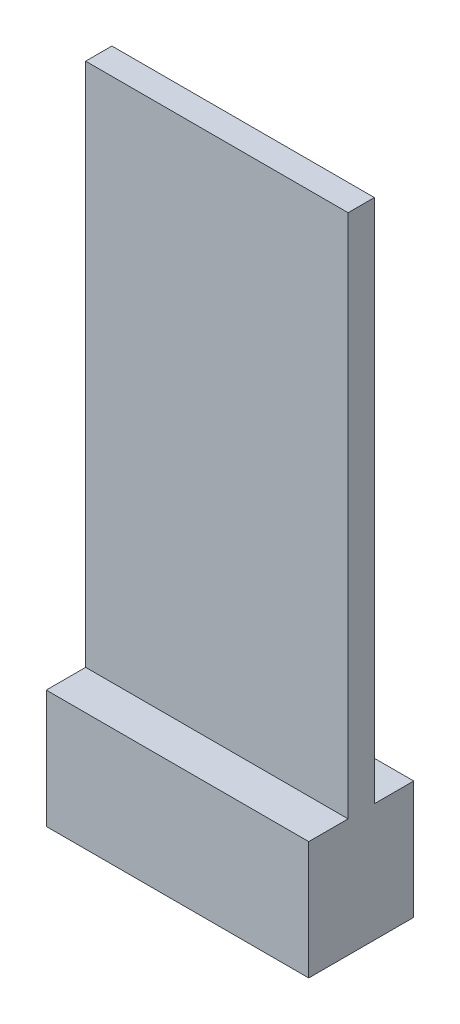
ISO-10303-21;
HEADER;
FILE_DESCRIPTION(('STEP AP214'),'2;1');
FILE_NAME('part.step','',(''),(''),'','','');
FILE_SCHEMA(('AUTOMOTIVE_DESIGN { 1 0 10303 214 1 1 1 1 }'));
ENDSEC;
DATA;
#1=APPLICATION_CONTEXT('core data for automotive mechanical design processes');
#2=APPLICATION_PROTOCOL_DEFINITION('international standard','automotive_design',2000,#1);
#3=PRODUCT_CONTEXT('',#1,'mechanical');
#4=PRODUCT('Part','Part','',(#3));
#5=PRODUCT_RELATED_PRODUCT_CATEGORY('part','',(#4));
#6=PRODUCT_DEFINITION_FORMATION('','',#4);
#7=PRODUCT_DEFINITION_CONTEXT('part definition',#1,'design');
#8=PRODUCT_DEFINITION('design','',#6,#7);
#9=PRODUCT_DEFINITION_SHAPE('','',#8);
#10=(LENGTH_UNIT() NAMED_UNIT(*) SI_UNIT(.MILLI.,.METRE.));
#11=(NAMED_UNIT(*) PLANE_ANGLE_UNIT() SI_UNIT($,.RADIAN.));
#12=(NAMED_UNIT(*) SI_UNIT($,.STERADIAN.) SOLID_ANGLE_UNIT());
#13=UNCERTAINTY_MEASURE_WITH_UNIT(LENGTH_MEASURE(1.E-05),#10,'distance_accuracy_value','');
#14=(GEOMETRIC_REPRESENTATION_CONTEXT(3) GLOBAL_UNCERTAINTY_ASSIGNED_CONTEXT((#13)) GLOBAL_UNIT_ASSIGNED_CONTEXT((#10,
#11,#12)) REPRESENTATION_CONTEXT('',''));
#15=CARTESIAN_POINT('',(0.,0.,0.));
#16=DIRECTION('',(0.,0.,1.));
#17=DIRECTION('',(1.,0.,0.));
#18=AXIS2_PLACEMENT_3D('',#15,#16,#17);
#19=CARTESIAN_POINT('',(10.,4.5,8.));
#20=DIRECTION('',(0.,-1.,0.));
#21=DIRECTION('',(1.,0.,0.));
#22=AXIS2_PLACEMENT_3D('',#19,#20,#21);
#23=PLANE('',#22);
#24=DIRECTION('',(1.,0.,0.));
#25=VECTOR('',#24,1.);
#26=CARTESIAN_POINT('',(-10.,4.5,5.));
#27=LINE('',#26,#25);
#28=CARTESIAN_POINT('',(-10.,4.5,5.));
#29=VERTEX_POINT('',#28);
#30=CARTESIAN_POINT('',(10.,4.5,5.));
#31=VERTEX_POINT('',#30);
#32=EDGE_CURVE('E142',#29,#31,#27,.T.);
#33=ORIENTED_EDGE('',*,*,#32,.F.);
#34=DIRECTION('',(0.,0.,-1.));
#35=VECTOR('',#34,1.);
#36=CARTESIAN_POINT('',(-10.,4.5,8.));
#37=LINE('',#36,#35);
#38=CARTESIAN_POINT('',(-10.,4.5,8.));
#39=VERTEX_POINT('',#38);
#40=EDGE_CURVE('E204',#39,#29,#37,.T.);
#41=ORIENTED_EDGE('',*,*,#40,.F.);
#42=DIRECTION('',(-1.,0.,0.));
#43=VECTOR('',#42,1.);
#44=CARTESIAN_POINT('',(10.,4.5,8.));
#45=LINE('',#44,#43);
#46=CARTESIAN_POINT('',(10.,4.5,8.));
#47=VERTEX_POINT('',#46);
#48=EDGE_CURVE('E193',#47,#39,#45,.T.);
#49=ORIENTED_EDGE('',*,*,#48,.F.);
#50=DIRECTION('',(0.,0.,-1.));
#51=VECTOR('',#50,1.);
#52=CARTESIAN_POINT('',(10.,4.5,8.));
#53=LINE('',#52,#51);
#54=EDGE_CURVE('E56',#47,#31,#53,.T.);
#55=ORIENTED_EDGE('',*,*,#54,.T.);
#56=EDGE_LOOP('',(#33,#41,#49,#55));
#57=FACE_BOUND('',#56,.T.);
#58=ADVANCED_FACE('F33',(#57),#23,.F.);
#59=DIRECTION('',(-1.,0.,0.));
#60=VECTOR('',#59,1.);
#61=CARTESIAN_POINT('',(-10.,4.5,3.));
#62=LINE('',#61,#60);
#63=CARTESIAN_POINT('',(10.,4.5,3.));
#64=VERTEX_POINT('',#63);
#65=CARTESIAN_POINT('',(-10.,4.5,3.));
#66=VERTEX_POINT('',#65);
#67=EDGE_CURVE('E48',#64,#66,#62,.T.);
#68=ORIENTED_EDGE('',*,*,#67,.F.);
#69=CARTESIAN_POINT('',(10.,4.5,0.));
#70=VERTEX_POINT('',#69);
#71=EDGE_CURVE('E146',#64,#70,#53,.T.);
#72=ORIENTED_EDGE('',*,*,#71,.T.);
#73=DIRECTION('',(-1.,0.,0.));
#74=VECTOR('',#73,1.);
#75=CARTESIAN_POINT('',(10.,4.5,0.));
#76=LINE('',#75,#74);
#77=CARTESIAN_POINT('',(-10.,4.5,0.));
#78=VERTEX_POINT('',#77);
#79=EDGE_CURVE('E189',#70,#78,#76,.T.);
#80=ORIENTED_EDGE('',*,*,#79,.T.);
#81=EDGE_CURVE('E195',#66,#78,#37,.T.);
#82=ORIENTED_EDGE('',*,*,#81,.F.);
#83=EDGE_LOOP('',(#68,#72,#80,#82));
#84=FACE_BOUND('',#83,.T.);
#85=ADVANCED_FACE('F216',(#84),#23,.F.);
#86=CARTESIAN_POINT('',(-10.,-4.5,8.));
#87=DIRECTION('',(1.,0.,0.));
#88=DIRECTION('',(0.,1.,0.));
#89=AXIS2_PLACEMENT_3D('',#86,#87,#88);
#90=PLANE('',#89);
#91=DIRECTION('',(0.,0.,-1.));
#92=VECTOR('',#91,1.);
#93=CARTESIAN_POINT('',(-10.,2.5,2.));
#94=LINE('',#93,#92);
#95=CARTESIAN_POINT('',(-10.,2.5,6.));
#96=VERTEX_POINT('',#95);
#97=CARTESIAN_POINT('',(-10.,2.5,2.));
#98=VERTEX_POINT('',#97);
#99=EDGE_CURVE('E149',#96,#98,#94,.T.);
#100=ORIENTED_EDGE('',*,*,#99,.F.);
#101=DIRECTION('',(0.,1.,0.));
#102=VECTOR('',#101,1.);
#103=CARTESIAN_POINT('',(-10.,-2.5,6.));
#104=LINE('',#103,#102);
#105=CARTESIAN_POINT('',(-10.,-2.5,6.));
#106=VERTEX_POINT('',#105);
#107=EDGE_CURVE('E147',#106,#96,#104,.T.);
#108=ORIENTED_EDGE('',*,*,#107,.F.);
#109=DIRECTION('',(0.,0.,1.));
#110=VECTOR('',#109,1.);
#111=CARTESIAN_POINT('',(-10.,-2.5,2.));
#112=LINE('',#111,#110);
#113=CARTESIAN_POINT('',(-10.,-2.5,2.));
#114=VERTEX_POINT('',#113);
#115=EDGE_CURVE('E159',#114,#106,#112,.T.);
#116=ORIENTED_EDGE('',*,*,#115,.F.);
#117=DIRECTION('',(0.,-1.,0.));
#118=VECTOR('',#117,1.);
#119=CARTESIAN_POINT('',(-10.,-2.5,2.));
#120=LINE('',#119,#118);
#121=EDGE_CURVE('E171',#98,#114,#120,.T.);
#122=ORIENTED_EDGE('',*,*,#121,.F.);
#123=EDGE_LOOP('',(#100,#108,#116,#122));
#124=FACE_BOUND('',#123,.T.);
#125=DIRECTION('',(0.,-1.,0.));
#126=VECTOR('',#125,1.);
#127=CARTESIAN_POINT('',(-10.,-4.5,0.));
#128=LINE('',#127,#126);
#129=CARTESIAN_POINT('',(-10.,-4.5,0.));
#130=VERTEX_POINT('',#129);
#131=EDGE_CURVE('E178',#78,#130,#128,.T.);
#132=ORIENTED_EDGE('',*,*,#131,.T.);
#133=DIRECTION('',(0.,0.,-1.));
#134=VECTOR('',#133,1.);
#135=CARTESIAN_POINT('',(-10.,-4.5,8.));
#136=LINE('',#135,#134);
#137=CARTESIAN_POINT('',(-10.,-4.5,8.));
#138=VERTEX_POINT('',#137);
#139=EDGE_CURVE('E11',#138,#130,#136,.T.);
#140=ORIENTED_EDGE('',*,*,#139,.F.);
#141=DIRECTION('',(0.,-1.,0.));
#142=VECTOR('',#141,1.);
#143=CARTESIAN_POINT('',(-10.,-4.5,8.));
#144=LINE('',#143,#142);
#145=EDGE_CURVE('E185',#39,#138,#144,.T.);
#146=ORIENTED_EDGE('',*,*,#145,.F.);
#147=ORIENTED_EDGE('',*,*,#40,.T.);
#148=DIRECTION('',(0.,-1.,0.));
#149=VECTOR('',#148,1.);
#150=CARTESIAN_POINT('',(-10.,44.5,5.));
#151=LINE('',#150,#149);
#152=CARTESIAN_POINT('',(-10.,44.5,5.));
#153=VERTEX_POINT('',#152);
#154=EDGE_CURVE('E151',#153,#29,#151,.T.);
#155=ORIENTED_EDGE('',*,*,#154,.F.);
#156=DIRECTION('',(0.,0.,1.));
#157=VECTOR('',#156,1.);
#158=CARTESIAN_POINT('',(-10.,44.5,3.));
#159=LINE('',#158,#157);
#160=CARTESIAN_POINT('',(-10.,44.5,3.));
#161=VERTEX_POINT('',#160);
#162=EDGE_CURVE('E132',#161,#153,#159,.T.);
#163=ORIENTED_EDGE('',*,*,#162,.F.);
#164=DIRECTION('',(0.,-1.,0.));
#165=VECTOR('',#164,1.);
#166=CARTESIAN_POINT('',(-10.,44.5,3.));
#167=LINE('',#166,#165);
#168=EDGE_CURVE('E129',#161,#66,#167,.T.);
#169=ORIENTED_EDGE('',*,*,#168,.T.);
#170=ORIENTED_EDGE('',*,*,#81,.T.);
#171=EDGE_LOOP('',(#132,#140,#146,#147,#155,#163,#169,#170));
#172=FACE_BOUND('',#171,.T.);
#173=ADVANCED_FACE('F35',(#124,#172),#90,.F.);
#174=CARTESIAN_POINT('',(10.,-4.5,8.));
#175=DIRECTION('',(0.,1.,0.));
#176=DIRECTION('',(-1.,0.,0.));
#177=AXIS2_PLACEMENT_3D('',#174,#175,#176);
#178=PLANE('',#177);
#179=DIRECTION('',(1.,0.,0.));
#180=VECTOR('',#179,1.);
#181=CARTESIAN_POINT('',(10.,-4.5,0.));
#182=LINE('',#181,#180);
#183=CARTESIAN_POINT('',(10.,-4.5,0.));
#184=VERTEX_POINT('',#183);
#185=EDGE_CURVE('E198',#130,#184,#182,.T.);
#186=ORIENTED_EDGE('',*,*,#185,.T.);
#187=DIRECTION('',(0.,0.,-1.));
#188=VECTOR('',#187,1.);
#189=CARTESIAN_POINT('',(10.,-4.5,8.));
#190=LINE('',#189,#188);
#191=CARTESIAN_POINT('',(10.,-4.5,8.));
#192=VERTEX_POINT('',#191);
#193=EDGE_CURVE('E41',#192,#184,#190,.T.);
#194=ORIENTED_EDGE('',*,*,#193,.F.);
#195=DIRECTION('',(1.,0.,0.));
#196=VECTOR('',#195,1.);
#197=CARTESIAN_POINT('',(10.,-4.5,8.));
#198=LINE('',#197,#196);
#199=EDGE_CURVE('E188',#138,#192,#198,.T.);
#200=ORIENTED_EDGE('',*,*,#199,.F.);
#201=ORIENTED_EDGE('',*,*,#139,.T.);
#202=EDGE_LOOP('',(#186,#194,#200,#201));
#203=FACE_BOUND('',#202,.T.);
#204=ADVANCED_FACE('F233',(#203),#178,.F.);
#205=CARTESIAN_POINT('',(10.,-4.5,8.));
#206=DIRECTION('',(-1.,0.,0.));
#207=DIRECTION('',(0.,-1.,0.));
#208=AXIS2_PLACEMENT_3D('',#205,#206,#207);
#209=PLANE('',#208);
#210=DIRECTION('',(0.,1.,0.));
#211=VECTOR('',#210,1.);
#212=CARTESIAN_POINT('',(10.,-4.5,0.));
#213=LINE('',#212,#211);
#214=EDGE_CURVE('E200',#184,#70,#213,.T.);
#215=ORIENTED_EDGE('',*,*,#214,.T.);
#216=ORIENTED_EDGE('',*,*,#71,.F.);
#217=DIRECTION('',(0.,-1.,0.));
#218=VECTOR('',#217,1.);
#219=CARTESIAN_POINT('',(9.99999999999999,44.5,3.));
#220=LINE('',#219,#218);
#221=CARTESIAN_POINT('',(9.99999999999999,44.5,3.));
#222=VERTEX_POINT('',#221);
#223=EDGE_CURVE('E127',#222,#64,#220,.T.);
#224=ORIENTED_EDGE('',*,*,#223,.F.);
#225=DIRECTION('',(0.,0.,-1.));
#226=VECTOR('',#225,1.);
#227=CARTESIAN_POINT('',(9.99999999999999,44.5,3.));
#228=LINE('',#227,#226);
#229=CARTESIAN_POINT('',(9.99999999999999,44.5,5.));
#230=VERTEX_POINT('',#229);
#231=EDGE_CURVE('E133',#230,#222,#228,.T.);
#232=ORIENTED_EDGE('',*,*,#231,.F.);
#233=DIRECTION('',(0.,-1.,0.));
#234=VECTOR('',#233,1.);
#235=CARTESIAN_POINT('',(9.99999999999999,44.5,5.));
#236=LINE('',#235,#234);
#237=EDGE_CURVE('E222',#230,#31,#236,.T.);
#238=ORIENTED_EDGE('',*,*,#237,.T.);
#239=ORIENTED_EDGE('',*,*,#54,.F.);
#240=DIRECTION('',(0.,1.,0.));
#241=VECTOR('',#240,1.);
#242=CARTESIAN_POINT('',(10.,-4.5,8.));
#243=LINE('',#242,#241);
#244=EDGE_CURVE('E191',#192,#47,#243,.T.);
#245=ORIENTED_EDGE('',*,*,#244,.F.);
#246=ORIENTED_EDGE('',*,*,#193,.T.);
#247=EDGE_LOOP('',(#215,#216,#224,#232,#238,#239,#245,#246));
#248=FACE_BOUND('',#247,.T.);
#249=ADVANCED_FACE('F145',(#248),#209,.F.);
#250=CARTESIAN_POINT('',(0.,0.,8.));
#251=DIRECTION('',(0.,0.,1.));
#252=DIRECTION('',(1.,0.,0.));
#253=AXIS2_PLACEMENT_3D('',#250,#251,#252);
#254=PLANE('',#253);
#255=ORIENTED_EDGE('',*,*,#145,.T.);
#256=ORIENTED_EDGE('',*,*,#199,.T.);
#257=ORIENTED_EDGE('',*,*,#244,.T.);
#258=ORIENTED_EDGE('',*,*,#48,.T.);
#259=EDGE_LOOP('',(#255,#256,#257,#258));
#260=FACE_BOUND('',#259,.T.);
#261=ADVANCED_FACE('F231',(#260),#254,.T.);
#262=CARTESIAN_POINT('',(0.,0.,0.));
#263=DIRECTION('',(0.,0.,1.));
#264=DIRECTION('',(1.,0.,0.));
#265=AXIS2_PLACEMENT_3D('',#262,#263,#264);
#266=PLANE('',#265);
#267=ORIENTED_EDGE('',*,*,#131,.F.);
#268=ORIENTED_EDGE('',*,*,#79,.F.);
#269=ORIENTED_EDGE('',*,*,#214,.F.);
#270=ORIENTED_EDGE('',*,*,#185,.F.);
#271=EDGE_LOOP('',(#267,#268,#269,#270));
#272=FACE_BOUND('',#271,.T.);
#273=ADVANCED_FACE('F215',(#272),#266,.F.);
#274=CARTESIAN_POINT('',(0.,-2.5,6.));
#275=DIRECTION('',(0.,0.,1.));
#276=DIRECTION('',(1.,0.,0.));
#277=AXIS2_PLACEMENT_3D('',#274,#275,#276);
#278=PLANE('',#277);
#279=ORIENTED_EDGE('',*,*,#107,.T.);
#280=DIRECTION('',(-1.,0.,0.));
#281=VECTOR('',#280,1.);
#282=CARTESIAN_POINT('',(0.,2.5,6.));
#283=LINE('',#282,#281);
#284=CARTESIAN_POINT('',(0.,2.5,6.));
#285=VERTEX_POINT('',#284);
#286=EDGE_CURVE('E167',#285,#96,#283,.T.);
#287=ORIENTED_EDGE('',*,*,#286,.F.);
#288=DIRECTION('',(0.,1.,0.));
#289=VECTOR('',#288,1.);
#290=CARTESIAN_POINT('',(0.,-2.5,6.));
#291=LINE('',#290,#289);
#292=CARTESIAN_POINT('',(0.,-2.5,6.));
#293=VERTEX_POINT('',#292);
#294=EDGE_CURVE('E155',#293,#285,#291,.T.);
#295=ORIENTED_EDGE('',*,*,#294,.F.);
#296=DIRECTION('',(-1.,0.,0.));
#297=VECTOR('',#296,1.);
#298=CARTESIAN_POINT('',(0.,-2.5,6.));
#299=LINE('',#298,#297);
#300=EDGE_CURVE('E176',#293,#106,#299,.T.);
#301=ORIENTED_EDGE('',*,*,#300,.T.);
#302=EDGE_LOOP('',(#279,#287,#295,#301));
#303=FACE_BOUND('',#302,.T.);
#304=ADVANCED_FACE('F249',(#303),#278,.F.);
#305=CARTESIAN_POINT('',(0.,-2.5,2.));
#306=DIRECTION('',(0.,-1.,0.));
#307=DIRECTION('',(0.,0.,-1.));
#308=AXIS2_PLACEMENT_3D('',#305,#306,#307);
#309=PLANE('',#308);
#310=ORIENTED_EDGE('',*,*,#115,.T.);
#311=ORIENTED_EDGE('',*,*,#300,.F.);
#312=DIRECTION('',(0.,0.,1.));
#313=VECTOR('',#312,1.);
#314=CARTESIAN_POINT('',(0.,-2.5,2.));
#315=LINE('',#314,#313);
#316=CARTESIAN_POINT('',(0.,-2.5,2.));
#317=VERTEX_POINT('',#316);
#318=EDGE_CURVE('E165',#317,#293,#315,.T.);
#319=ORIENTED_EDGE('',*,*,#318,.F.);
#320=DIRECTION('',(-1.,0.,0.));
#321=VECTOR('',#320,1.);
#322=CARTESIAN_POINT('',(0.,-2.5,2.));
#323=LINE('',#322,#321);
#324=EDGE_CURVE('E179',#317,#114,#323,.T.);
#325=ORIENTED_EDGE('',*,*,#324,.T.);
#326=EDGE_LOOP('',(#310,#311,#319,#325));
#327=FACE_BOUND('',#326,.T.);
#328=ADVANCED_FACE('F254',(#327),#309,.F.);
#329=CARTESIAN_POINT('',(0.,-2.5,2.));
#330=DIRECTION('',(0.,0.,-1.));
#331=DIRECTION('',(0.,1.,0.));
#332=AXIS2_PLACEMENT_3D('',#329,#330,#331);
#333=PLANE('',#332);
#334=ORIENTED_EDGE('',*,*,#121,.T.);
#335=ORIENTED_EDGE('',*,*,#324,.F.);
#336=DIRECTION('',(0.,-1.,0.));
#337=VECTOR('',#336,1.);
#338=CARTESIAN_POINT('',(0.,-2.5,2.));
#339=LINE('',#338,#337);
#340=CARTESIAN_POINT('',(0.,2.5,2.));
#341=VERTEX_POINT('',#340);
#342=EDGE_CURVE('E162',#341,#317,#339,.T.);
#343=ORIENTED_EDGE('',*,*,#342,.F.);
#344=DIRECTION('',(-1.,0.,0.));
#345=VECTOR('',#344,1.);
#346=CARTESIAN_POINT('',(0.,2.5,2.));
#347=LINE('',#346,#345);
#348=EDGE_CURVE('E181',#341,#98,#347,.T.);
#349=ORIENTED_EDGE('',*,*,#348,.T.);
#350=EDGE_LOOP('',(#334,#335,#343,#349));
#351=FACE_BOUND('',#350,.T.);
#352=ADVANCED_FACE('F260',(#351),#333,.F.);
#353=CARTESIAN_POINT('',(0.,2.5,2.));
#354=DIRECTION('',(0.,1.,0.));
#355=DIRECTION('',(-1.,0.,0.));
#356=AXIS2_PLACEMENT_3D('',#353,#354,#355);
#357=PLANE('',#356);
#358=ORIENTED_EDGE('',*,*,#99,.T.);
#359=ORIENTED_EDGE('',*,*,#348,.F.);
#360=DIRECTION('',(0.,0.,-1.));
#361=VECTOR('',#360,1.);
#362=CARTESIAN_POINT('',(0.,2.5,2.));
#363=LINE('',#362,#361);
#364=EDGE_CURVE('E158',#285,#341,#363,.T.);
#365=ORIENTED_EDGE('',*,*,#364,.F.);
#366=ORIENTED_EDGE('',*,*,#286,.T.);
#367=EDGE_LOOP('',(#358,#359,#365,#366));
#368=FACE_BOUND('',#367,.T.);
#369=ADVANCED_FACE('F256',(#368),#357,.F.);
#370=CARTESIAN_POINT('',(0.,0.,0.));
#371=DIRECTION('',(1.,0.,0.));
#372=DIRECTION('',(0.,0.,-1.));
#373=AXIS2_PLACEMENT_3D('',#370,#371,#372);
#374=PLANE('',#373);
#375=ORIENTED_EDGE('',*,*,#294,.T.);
#376=ORIENTED_EDGE('',*,*,#364,.T.);
#377=ORIENTED_EDGE('',*,*,#342,.T.);
#378=ORIENTED_EDGE('',*,*,#318,.T.);
#379=EDGE_LOOP('',(#375,#376,#377,#378));
#380=FACE_BOUND('',#379,.T.);
#381=ADVANCED_FACE('F259',(#380),#374,.F.);
#382=CARTESIAN_POINT('',(-10.,44.5,3.));
#383=DIRECTION('',(0.,0.,1.));
#384=DIRECTION('',(1.,0.,0.));
#385=AXIS2_PLACEMENT_3D('',#382,#383,#384);
#386=PLANE('',#385);
#387=ORIENTED_EDGE('',*,*,#67,.T.);
#388=ORIENTED_EDGE('',*,*,#168,.F.);
#389=DIRECTION('',(-1.,0.,0.));
#390=VECTOR('',#389,1.);
#391=CARTESIAN_POINT('',(-10.,44.5,3.));
#392=LINE('',#391,#390);
#393=EDGE_CURVE('E123',#222,#161,#392,.T.);
#394=ORIENTED_EDGE('',*,*,#393,.F.);
#395=ORIENTED_EDGE('',*,*,#223,.T.);
#396=EDGE_LOOP('',(#387,#388,#394,#395));
#397=FACE_BOUND('',#396,.T.);
#398=ADVANCED_FACE('F125',(#397),#386,.F.);
#399=CARTESIAN_POINT('',(-10.,44.5,5.));
#400=DIRECTION('',(0.,0.,-1.));
#401=DIRECTION('',(-1.,0.,0.));
#402=AXIS2_PLACEMENT_3D('',#399,#400,#401);
#403=PLANE('',#402);
#404=ORIENTED_EDGE('',*,*,#32,.T.);
#405=ORIENTED_EDGE('',*,*,#237,.F.);
#406=DIRECTION('',(1.,0.,0.));
#407=VECTOR('',#406,1.);
#408=CARTESIAN_POINT('',(-10.,44.5,5.));
#409=LINE('',#408,#407);
#410=EDGE_CURVE('E138',#153,#230,#409,.T.);
#411=ORIENTED_EDGE('',*,*,#410,.F.);
#412=ORIENTED_EDGE('',*,*,#154,.T.);
#413=EDGE_LOOP('',(#404,#405,#411,#412));
#414=FACE_BOUND('',#413,.T.);
#415=ADVANCED_FACE('F227',(#414),#403,.F.);
#416=CARTESIAN_POINT('',(0.,44.5,0.));
#417=DIRECTION('',(0.,1.,0.));
#418=DIRECTION('',(-1.,0.,0.));
#419=AXIS2_PLACEMENT_3D('',#416,#417,#418);
#420=PLANE('',#419);
#421=ORIENTED_EDGE('',*,*,#231,.T.);
#422=ORIENTED_EDGE('',*,*,#393,.T.);
#423=ORIENTED_EDGE('',*,*,#162,.T.);
#424=ORIENTED_EDGE('',*,*,#410,.T.);
#425=EDGE_LOOP('',(#421,#422,#423,#424));
#426=FACE_BOUND('',#425,.T.);
#427=ADVANCED_FACE('F136',(#426),#420,.T.);
#428=CLOSED_SHELL('',(#58,#85,#173,#204,#249,#261,#273,#304,#328,#352,#369,#381,#398,#415,#427));
#429=MANIFOLD_SOLID_BREP('B2',#428);
#430=ADVANCED_BREP_SHAPE_REPRESENTATION('',(#18,#429),#14);
#431=SHAPE_DEFINITION_REPRESENTATION(#9,#430);
ENDSEC;
END-ISO-10303-21;
